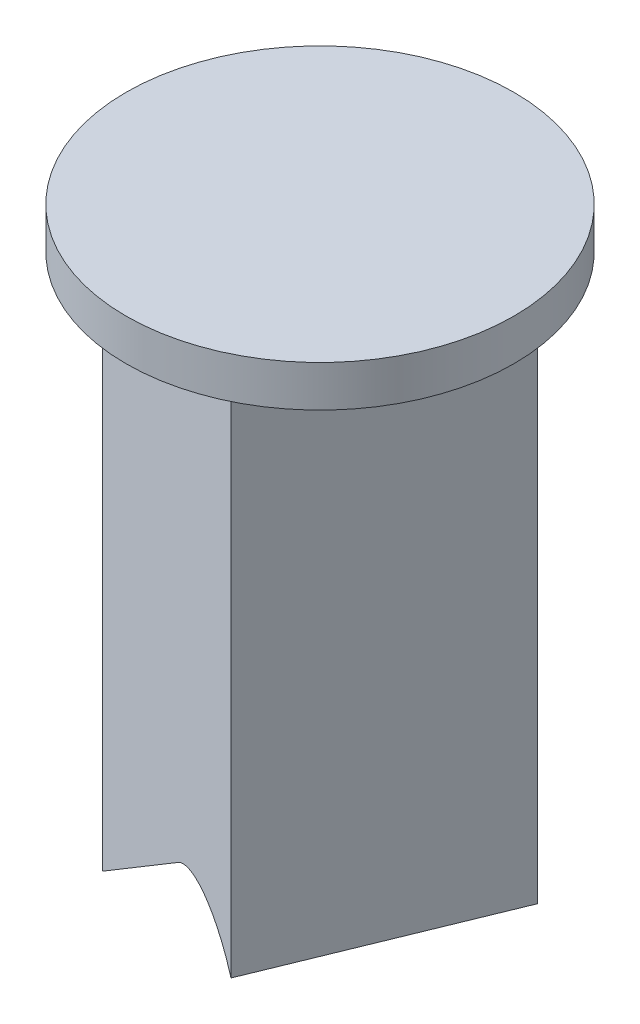
ISO-10303-21;
HEADER;
FILE_DESCRIPTION(('STEP AP214'),'2;1');
FILE_NAME('part.step','',(''),(''),'','','');
FILE_SCHEMA(('AUTOMOTIVE_DESIGN { 1 0 10303 214 1 1 1 1 }'));
ENDSEC;
DATA;
#1=APPLICATION_CONTEXT('core data for automotive mechanical design processes');
#2=APPLICATION_PROTOCOL_DEFINITION('international standard','automotive_design',2000,#1);
#3=PRODUCT_CONTEXT('',#1,'mechanical');
#4=PRODUCT('Part','Part','',(#3));
#5=PRODUCT_RELATED_PRODUCT_CATEGORY('part','',(#4));
#6=PRODUCT_DEFINITION_FORMATION('','',#4);
#7=PRODUCT_DEFINITION_CONTEXT('part definition',#1,'design');
#8=PRODUCT_DEFINITION('design','',#6,#7);
#9=PRODUCT_DEFINITION_SHAPE('','',#8);
#10=(LENGTH_UNIT() NAMED_UNIT(*) SI_UNIT(.MILLI.,.METRE.));
#11=(NAMED_UNIT(*) PLANE_ANGLE_UNIT() SI_UNIT($,.RADIAN.));
#12=(NAMED_UNIT(*) SI_UNIT($,.STERADIAN.) SOLID_ANGLE_UNIT());
#13=UNCERTAINTY_MEASURE_WITH_UNIT(LENGTH_MEASURE(1.E-05),#10,'distance_accuracy_value','');
#14=(GEOMETRIC_REPRESENTATION_CONTEXT(3) GLOBAL_UNCERTAINTY_ASSIGNED_CONTEXT((#13)) GLOBAL_UNIT_ASSIGNED_CONTEXT((#10,
#11,#12)) REPRESENTATION_CONTEXT('',''));
#15=CARTESIAN_POINT('',(0.,0.,0.));
#16=DIRECTION('',(0.,0.,1.));
#17=DIRECTION('',(1.,0.,0.));
#18=AXIS2_PLACEMENT_3D('',#15,#16,#17);
#19=CARTESIAN_POINT('',(1.69679025132942,84.4279828908245,-0.231428375549563));
#20=DIRECTION('',(0.990826424131254,0.,-0.13514065725485));
#21=DIRECTION('',(-0.13514065725485,0.,-0.990826424131254));
#22=AXIS2_PLACEMENT_3D('',#19,#20,#21);
#23=PLANE('',#22);
#24=DIRECTION('',(-0.13514065725485,0.,-0.990826424131254));
#25=VECTOR('',#24,1.);
#26=CARTESIAN_POINT('',(1.69679025132941,105.994845223969,-0.231428375549563));
#27=LINE('',#26,#25);
#28=CARTESIAN_POINT('',(1.87402518821242,105.994845223969,1.06802555867063));
#29=VERTEX_POINT('',#28);
#30=CARTESIAN_POINT('',(1.51955531444767,105.994845223969,-1.5308823097605));
#31=VERTEX_POINT('',#30);
#32=EDGE_CURVE('E194',#29,#31,#27,.T.);
#33=ORIENTED_EDGE('',*,*,#32,.T.);
#34=DIRECTION('',(0.,1.,0.));
#35=VECTOR('',#34,1.);
#36=CARTESIAN_POINT('',(1.51955531444767,84.4279828908245,-1.5308823097605));
#37=LINE('',#36,#35);
#38=CARTESIAN_POINT('',(1.51955531444767,99.1625960772667,-1.5308823097605));
#39=VERTEX_POINT('',#38);
#40=EDGE_CURVE('E191',#39,#31,#37,.T.);
#41=ORIENTED_EDGE('',*,*,#40,.F.);
#42=CARTESIAN_POINT('',(1.56317408094084,97.596592381683,-1.2110775425842));
#43=DIRECTION('',(0.990826424131254,0.,-0.13514065725485));
#44=DIRECTION('',(-0.0780237679722807,-0.816495151816892,-0.572055905214621));
#45=AXIS2_PLACEMENT_3D('',#42,#43,#44);
#46=ELLIPSE('',#45,1.97990245275013,1.4);
#47=CARTESIAN_POINT('',(1.71765298975573,99.2131759649167,-0.0784666175380269));
#48=VERTEX_POINT('',#47);
#49=EDGE_CURVE('E308',#39,#48,#46,.T.);
#50=ORIENTED_EDGE('',*,*,#49,.T.);
#51=DIRECTION('',(0.110342077724226,-0.577348248112858,0.80900780359927));
#52=VECTOR('',#51,1.);
#53=CARTESIAN_POINT('',(2.64564707959972,94.3575871172102,6.72541523661846));
#54=LINE('',#53,#52);
#55=CARTESIAN_POINT('',(1.87402518821242,98.3949820655943,1.06802555867063));
#56=VERTEX_POINT('',#55);
#57=EDGE_CURVE('E306',#48,#56,#54,.T.);
#58=ORIENTED_EDGE('',*,*,#57,.T.);
#59=DIRECTION('',(0.,1.,0.));
#60=VECTOR('',#59,1.);
#61=CARTESIAN_POINT('',(1.87402518821242,84.4279828908245,1.06802555867063));
#62=LINE('',#61,#60);
#63=EDGE_CURVE('E242',#56,#29,#62,.T.);
#64=ORIENTED_EDGE('',*,*,#63,.T.);
#65=EDGE_LOOP('',(#33,#41,#50,#58,#64));
#66=FACE_BOUND('',#65,.T.);
#67=ADVANCED_FACE('F45',(#66),#23,.F.);
#68=CARTESIAN_POINT('',(5.27521365824453E-12,84.4279828908245,3.99486966809603E-12));
#69=DIRECTION('',(0.,1.,0.));
#70=DIRECTION('',(-1.,0.,0.));
#71=AXIS2_PLACEMENT_3D('',#68,#69,#70);
#72=CYLINDRICAL_SURFACE('',#71,2.157);
#73=CARTESIAN_POINT('',(5.26940020144552E-12,105.994845223969,3.99574957758482E-12));
#74=DIRECTION('',(0.,1.,0.));
#75=DIRECTION('',(0.,0.,1.));
#76=AXIS2_PLACEMENT_3D('',#73,#74,#75);
#77=CIRCLE('',#76,2.157);
#78=CARTESIAN_POINT('',(1.53088230976976,105.994845223969,1.51955531444639));
#79=VERTEX_POINT('',#78);
#80=EDGE_CURVE('E60',#79,#29,#77,.T.);
#81=ORIENTED_EDGE('',*,*,#80,.T.);
#82=ORIENTED_EDGE('',*,*,#63,.F.);
#83=CARTESIAN_POINT('',(5.27063345056733E-12,101.419716354481,3.99556291625029E-12));
#84=DIRECTION('',(0.755791962372009,0.577350269189626,0.308942027378171));
#85=DIRECTION('',(-0.534425621759536,0.816496580927726,-0.218455002552625));
#86=AXIS2_PLACEMENT_3D('',#83,#84,#85);
#87=ELLIPSE('',#86,3.73603359192607,2.157);
#88=CARTESIAN_POINT('',(1.53088230976977,98.6025650835591,1.51955531444639));
#89=VERTEX_POINT('',#88);
#90=EDGE_CURVE('E304',#56,#89,#87,.F.);
#91=ORIENTED_EDGE('',*,*,#90,.T.);
#92=DIRECTION('',(0.,1.,0.));
#93=VECTOR('',#92,1.);
#94=CARTESIAN_POINT('',(1.53088230976977,84.4279828908245,1.51955531444639));
#95=LINE('',#94,#93);
#96=EDGE_CURVE('E240',#89,#79,#95,.T.);
#97=ORIENTED_EDGE('',*,*,#96,.T.);
#98=EDGE_LOOP('',(#81,#82,#91,#97));
#99=FACE_BOUND('',#98,.T.);
#100=ADVANCED_FACE('F363',(#99),#72,.F.);
#101=CARTESIAN_POINT('',(0.231428375549567,84.4279828908245,1.6967902513294));
#102=DIRECTION('',(0.135140657254849,0.,0.990826424131254));
#103=DIRECTION('',(0.990826424131254,0.,-0.135140657254849));
#104=AXIS2_PLACEMENT_3D('',#101,#102,#103);
#105=PLANE('',#104);
#106=DIRECTION('',(0.990826424131254,0.,-0.135140657254849));
#107=VECTOR('',#106,1.);
#108=CARTESIAN_POINT('',(0.231428375549562,105.994845223969,1.6967902513294));
#109=LINE('',#108,#107);
#110=CARTESIAN_POINT('',(-1.06802555866137,105.994845223969,1.87402518821114));
#111=VERTEX_POINT('',#110);
#112=EDGE_CURVE('E68',#111,#79,#109,.T.);
#113=ORIENTED_EDGE('',*,*,#112,.T.);
#114=ORIENTED_EDGE('',*,*,#96,.F.);
#115=DIRECTION('',(-0.626652995130878,0.774597211549112,0.0854703665245491));
#116=VECTOR('',#115,1.);
#117=CARTESIAN_POINT('',(7.89149594051099,90.7402974164519,0.652019401326001));
#118=LINE('',#117,#116);
#119=CARTESIAN_POINT('',(1.2123016364258,98.9963583042778,1.56300712450702));
#120=VERTEX_POINT('',#119);
#121=EDGE_CURVE('E292',#89,#120,#118,.T.);
#122=ORIENTED_EDGE('',*,*,#121,.T.);
#123=CARTESIAN_POINT('',(0.231433519546333,97.7839248611027,1.69678954973012));
#124=DIRECTION('',(0.135140657254849,0.,0.990826424131254));
#125=DIRECTION('',(-4.24800605209362E-06,0.999999999990809,5.79393439582368E-07));
#126=AXIS2_PLACEMENT_3D('',#123,#124,#125);
#127=ELLIPSE('',#126,1.7146428199561,1.4);
#128=CARTESIAN_POINT('',(-0.749434597332885,98.996362548524,1.83057197495319));
#129=VERTEX_POINT('',#128);
#130=EDGE_CURVE('E289',#120,#129,#127,.T.);
#131=ORIENTED_EDGE('',*,*,#130,.T.);
#132=DIRECTION('',(0.626654311327413,0.774596126929299,-0.0854705460430404));
#133=VECTOR('',#132,1.);
#134=CARTESIAN_POINT('',(-7.42863837957463,90.7403188459972,2.74156099087759));
#135=LINE('',#134,#133);
#136=CARTESIAN_POINT('',(-1.06802555866136,98.6025579895209,1.87402518821114));
#137=VERTEX_POINT('',#136);
#138=EDGE_CURVE('E286',#137,#129,#135,.T.);
#139=ORIENTED_EDGE('',*,*,#138,.F.);
#140=DIRECTION('',(0.,1.,0.));
#141=VECTOR('',#140,1.);
#142=CARTESIAN_POINT('',(-1.06802555866136,84.4279828908245,1.87402518821114));
#143=LINE('',#142,#141);
#144=EDGE_CURVE('E238',#137,#111,#143,.T.);
#145=ORIENTED_EDGE('',*,*,#144,.T.);
#146=EDGE_LOOP('',(#113,#114,#122,#131,#139,#145));
#147=FACE_BOUND('',#146,.T.);
#148=ADVANCED_FACE('F367',(#147),#105,.F.);
#149=CARTESIAN_POINT('',(5.27521365824453E-12,84.4279828908245,3.99486966809603E-12));
#150=DIRECTION('',(0.,1.,0.));
#151=DIRECTION('',(-1.,0.,0.));
#152=AXIS2_PLACEMENT_3D('',#149,#150,#151);
#153=CYLINDRICAL_SURFACE('',#152,2.157);
#154=CARTESIAN_POINT('',(5.26940020144552E-12,105.994845223969,3.99574957758482E-12));
#155=DIRECTION('',(0.,1.,0.));
#156=DIRECTION('',(0.,0.,1.));
#157=AXIS2_PLACEMENT_3D('',#154,#155,#156);
#158=CIRCLE('',#157,2.157);
#159=CARTESIAN_POINT('',(-1.51955531443713,105.994845223969,1.53088230976849));
#160=VERTEX_POINT('',#159);
#161=EDGE_CURVE('E206',#160,#111,#158,.T.);
#162=ORIENTED_EDGE('',*,*,#161,.T.);
#163=ORIENTED_EDGE('',*,*,#144,.F.);
#164=CARTESIAN_POINT('',(5.27063345056733E-12,101.419716354493,3.99556291625029E-12));
#165=DIRECTION('',(0.645447625192169,-0.577350269189626,-0.500064025701167));
#166=DIRECTION('',(0.456400392674135,0.816496580927726,-0.353598663600739));
#167=AXIS2_PLACEMENT_3D('',#164,#165,#166);
#168=ELLIPSE('',#167,3.73603359192607,2.157);
#169=CARTESIAN_POINT('',(-1.51955531443713,98.3949796687338,1.53088230976849));
#170=VERTEX_POINT('',#169);
#171=EDGE_CURVE('E284',#170,#137,#168,.F.);
#172=ORIENTED_EDGE('',*,*,#171,.F.);
#173=DIRECTION('',(0.,1.,0.));
#174=VECTOR('',#173,1.);
#175=CARTESIAN_POINT('',(-1.51955531443712,84.4279828908245,1.53088230976849));
#176=LINE('',#175,#174);
#177=EDGE_CURVE('E235',#170,#160,#176,.T.);
#178=ORIENTED_EDGE('',*,*,#177,.T.);
#179=EDGE_LOOP('',(#162,#163,#172,#178));
#180=FACE_BOUND('',#179,.T.);
#181=ADVANCED_FACE('F370',(#180),#153,.F.);
#182=CARTESIAN_POINT('',(-1.69679025132013,84.4279828908245,0.231428375548295));
#183=DIRECTION('',(-0.990826424131254,0.,0.135140657254849));
#184=DIRECTION('',(0.135140657254849,0.,0.990826424131254));
#185=AXIS2_PLACEMENT_3D('',#182,#183,#184);
#186=PLANE('',#185);
#187=DIRECTION('',(0.135140657254849,0.,0.990826424131254));
#188=VECTOR('',#187,1.);
#189=CARTESIAN_POINT('',(-1.69679025132013,105.994845223969,0.231428375548297));
#190=LINE('',#189,#188);
#191=CARTESIAN_POINT('',(-1.87402518820188,105.994845223969,-1.06802555866264));
#192=VERTEX_POINT('',#191);
#193=EDGE_CURVE('E201',#192,#160,#190,.T.);
#194=ORIENTED_EDGE('',*,*,#193,.T.);
#195=ORIENTED_EDGE('',*,*,#177,.F.);
#196=DIRECTION('',(0.110341691461932,-0.577352290252244,0.809004971595235));
#197=VECTOR('',#196,1.);
#198=CARTESIAN_POINT('',(-0.747929633745744,94.3575224930994,7.18829977019641));
#199=LINE('',#198,#197);
#200=CARTESIAN_POINT('',(-1.67592618272878,99.2131752006381,0.384399886085006));
#201=VERTEX_POINT('',#200);
#202=EDGE_CURVE('E258',#201,#170,#199,.T.);
#203=ORIENTED_EDGE('',*,*,#202,.F.);
#204=CARTESIAN_POINT('',(-1.83040455077643,97.5965972763998,-0.748207074155332));
#205=DIRECTION('',(-0.990826424131254,0.,0.135140657254849));
#206=DIRECTION('',(0.0780232217149068,0.816498010041062,0.572051900156106));
#207=AXIS2_PLACEMENT_3D('',#204,#205,#206);
#208=ELLIPSE('',#207,1.97989552192486,1.4);
#209=CARTESIAN_POINT('',(-1.87402518820188,99.1625940393697,-1.06802555866264));
#210=VERTEX_POINT('',#209);
#211=EDGE_CURVE('E293',#201,#210,#208,.T.);
#212=ORIENTED_EDGE('',*,*,#211,.T.);
#213=DIRECTION('',(0.,1.,0.));
#214=VECTOR('',#213,1.);
#215=CARTESIAN_POINT('',(-1.87402518820187,84.4279828908245,-1.06802555866264));
#216=LINE('',#215,#214);
#217=EDGE_CURVE('E232',#210,#192,#216,.T.);
#218=ORIENTED_EDGE('',*,*,#217,.T.);
#219=EDGE_LOOP('',(#194,#195,#203,#212,#218));
#220=FACE_BOUND('',#219,.T.);
#221=ADVANCED_FACE('F372',(#220),#186,.F.);
#222=CARTESIAN_POINT('',(5.27521365824453E-12,84.4279828908245,3.99486966809603E-12));
#223=DIRECTION('',(0.,1.,0.));
#224=DIRECTION('',(-1.,0.,0.));
#225=AXIS2_PLACEMENT_3D('',#222,#223,#224);
#226=CYLINDRICAL_SURFACE('',#225,2.157);
#227=CARTESIAN_POINT('',(5.26940020144552E-12,105.994845223969,3.99574957758482E-12));
#228=DIRECTION('',(0.,1.,0.));
#229=DIRECTION('',(0.,0.,1.));
#230=AXIS2_PLACEMENT_3D('',#227,#228,#229);
#231=CIRCLE('',#230,2.157);
#232=CARTESIAN_POINT('',(-1.53088230975923,105.994845223969,-1.5195553144384));
#233=VERTEX_POINT('',#232);
#234=EDGE_CURVE('E199',#233,#192,#231,.T.);
#235=ORIENTED_EDGE('',*,*,#234,.T.);
#236=ORIENTED_EDGE('',*,*,#217,.F.);
#237=CARTESIAN_POINT('',(-1.87402518820187,99.1625940393697,-1.06802555866264));
#238=CARTESIAN_POINT('',(-1.85465083730353,99.1564941999162,-1.10203711976674));
#239=CARTESIAN_POINT('',(-1.83443667333543,99.1491067680724,-1.13533892768894));
#240=CARTESIAN_POINT('',(-1.79256624378793,99.131746908743,-1.20035065552737));
#241=CARTESIAN_POINT('',(-1.77090917986237,99.1217730412254,-1.23205967686143));
#242=CARTESIAN_POINT('',(-1.72681027719391,99.0994386767081,-1.29312446758193));
#243=CARTESIAN_POINT('',(-1.70438938174293,99.0871240199009,-1.32251216643267));
#244=CARTESIAN_POINT('',(-1.65869767401704,99.0599943798302,-1.37938373411636));
#245=CARTESIAN_POINT('',(-1.63542742775374,99.0451810386966,-1.406868836707));
#246=CARTESIAN_POINT('',(-1.59855445191809,99.0200105670649,-1.44833556164797));
#247=CARTESIAN_POINT('',(-1.58513459856235,99.0105060223948,-1.4630051455999));
#248=CARTESIAN_POINT('',(-1.55811307807551,98.9906357193597,-1.49175204676862));
#249=CARTESIAN_POINT('',(-1.54451083099199,98.9802657858668,-1.50582593256331));
#250=CARTESIAN_POINT('',(-1.53088230975925,98.9694841279891,-1.51955531443842));
#251=B_SPLINE_CURVE_WITH_KNOTS('',3,(#237,#238,#239,#240,#241,#242,#243,#244,#245,#246,#247,
#248,#249,#250),.UNSPECIFIED.,.F.,.F.,(4,2,2,2,2,2,4),(0.,0.118809772325773,0.237685836105329,
0.354437320291312,0.471112372494199,0.537200489031344,0.60362826349208),.UNSPECIFIED.);
#252=CARTESIAN_POINT('',(-1.53088230975922,98.9694841279891,-1.5195553144384));
#253=VERTEX_POINT('',#252);
#254=EDGE_CURVE('E260',#210,#253,#251,.T.);
#255=ORIENTED_EDGE('',*,*,#254,.T.);
#256=DIRECTION('',(0.,1.,0.));
#257=VECTOR('',#256,1.);
#258=CARTESIAN_POINT('',(-1.53088230975922,84.4279828908245,-1.5195553144384));
#259=LINE('',#258,#257);
#260=EDGE_CURVE('E183',#253,#233,#259,.T.);
#261=ORIENTED_EDGE('',*,*,#260,.T.);
#262=EDGE_LOOP('',(#235,#236,#255,#261));
#263=FACE_BOUND('',#262,.T.);
#264=ADVANCED_FACE('F317',(#263),#226,.F.);
#265=CARTESIAN_POINT('',(5.27521365824453E-12,84.4279828908245,3.99486966809603E-12));
#266=DIRECTION('',(0.,1.,0.));
#267=DIRECTION('',(-1.,0.,0.));
#268=AXIS2_PLACEMENT_3D('',#265,#266,#267);
#269=CYLINDRICAL_SURFACE('',#268,2.157);
#270=CARTESIAN_POINT('',(5.26940020144552E-12,105.994845223969,3.99574957758482E-12));
#271=DIRECTION('',(0.,1.,0.));
#272=DIRECTION('',(0.,0.,1.));
#273=AXIS2_PLACEMENT_3D('',#270,#271,#272);
#274=CIRCLE('',#273,2.157);
#275=CARTESIAN_POINT('',(1.06802555867191,105.994845223969,-1.87402518820315));
#276=VERTEX_POINT('',#275);
#277=EDGE_CURVE('E188',#31,#276,#274,.T.);
#278=ORIENTED_EDGE('',*,*,#277,.T.);
#279=DIRECTION('',(0.,1.,0.));
#280=VECTOR('',#279,1.);
#281=CARTESIAN_POINT('',(1.06802555867191,84.4279828908245,-1.87402518820315));
#282=LINE('',#281,#280);
#283=CARTESIAN_POINT('',(1.06802555867191,98.9694914171116,-1.87402518820315));
#284=VERTEX_POINT('',#283);
#285=EDGE_CURVE('E172',#284,#276,#282,.T.);
#286=ORIENTED_EDGE('',*,*,#285,.F.);
#287=CARTESIAN_POINT('',(1.06802555867191,98.9694914171116,-1.87402518820315));
#288=CARTESIAN_POINT('',(1.09809619765169,98.9887777007371,-1.85689718371007));
#289=CARTESIAN_POINT('',(1.1283796103064,99.0067500255236,-1.83867068293678));
#290=CARTESIAN_POINT('',(1.18901947366323,99.0400890522579,-1.80004577718457));
#291=CARTESIAN_POINT('',(1.21937595097576,99.055454585142,-1.77964640438208));
#292=CARTESIAN_POINT('',(1.27924527818538,99.0833352057266,-1.73709758434953));
#293=CARTESIAN_POINT('',(1.30876353441583,99.0958960857136,-1.71498566880566));
#294=CARTESIAN_POINT('',(1.36718128246435,99.1185137524441,-1.66878668451081));
#295=CARTESIAN_POINT('',(1.39608114601738,99.1285720845369,-1.6447008469554));
#296=CARTESIAN_POINT('',(1.44064638245244,99.1423758300479,-1.60550558507958));
#297=CARTESIAN_POINT('',(1.45661669966268,99.1469674485755,-1.59103243947302));
#298=CARTESIAN_POINT('',(1.48830721497731,99.1553747239066,-1.56142995569133));
#299=CARTESIAN_POINT('',(1.50402571721855,99.1591862941836,-1.54629764139145));
#300=CARTESIAN_POINT('',(1.51955531444767,99.1625960772667,-1.5308823097605));
#301=B_SPLINE_CURVE_WITH_KNOTS('',3,(#287,#288,#289,#290,#291,#292,#293,#294,#295,#296,#297,
#298,#299,#300),.UNSPECIFIED.,.F.,.F.,(4,2,2,2,2,2,4),(0.,0.118812400058613,0.237677943665814,
0.354431664658317,0.471113109073768,0.537200516989114,0.603625749227535),.UNSPECIFIED.);
#302=EDGE_CURVE('E281',#284,#39,#301,.T.);
#303=ORIENTED_EDGE('',*,*,#302,.T.);
#304=ORIENTED_EDGE('',*,*,#40,.T.);
#305=EDGE_LOOP('',(#278,#286,#303,#304));
#306=FACE_BOUND('',#305,.T.);
#307=ADVANCED_FACE('F189',(#306),#269,.F.);
#308=CARTESIAN_POINT('',(-0.231428375548291,84.4279828908245,-1.69679025132014));
#309=DIRECTION('',(-0.135140657254849,0.,-0.990826424131254));
#310=DIRECTION('',(-0.990826424131254,0.,0.135140657254849));
#311=AXIS2_PLACEMENT_3D('',#308,#309,#310);
#312=PLANE('',#311);
#313=DIRECTION('',(-0.990826424131254,0.,0.135140657254849));
#314=VECTOR('',#313,1.);
#315=CARTESIAN_POINT('',(-0.231428375548297,105.994845223969,-1.69679025132014));
#316=LINE('',#315,#314);
#317=EDGE_CURVE('E177',#276,#233,#316,.T.);
#318=ORIENTED_EDGE('',*,*,#317,.T.);
#319=ORIENTED_EDGE('',*,*,#260,.F.);
#320=CARTESIAN_POINT('',(-3.17037587672488,96.5729917814238,-1.2959417401445));
#321=DIRECTION('',(-0.135140657254849,0.,-0.990826424131254));
#322=DIRECTION('',(0.767491385261247,0.632454867844608,-0.10467957627652));
#323=AXIS2_PLACEMENT_3D('',#320,#321,#322);
#324=ELLIPSE('',#323,3.42930364681904,1.4);
#325=CARTESIAN_POINT('',(-1.20862934204489,98.9978714005574,-1.56350799555247));
#326=VERTEX_POINT('',#325);
#327=EDGE_CURVE('E246',#253,#326,#324,.T.);
#328=ORIENTED_EDGE('',*,*,#327,.T.);
#329=DIRECTION('',(-0.990826424122147,-4.28733625660042E-06,0.135140657253607));
#330=VECTOR('',#329,1.);
#331=CARTESIAN_POINT('',(-0.231490268540822,98.9978756286681,-1.69678180961988));
#332=LINE('',#331,#330);
#333=CARTESIAN_POINT('',(0.745752040706169,98.9978798572255,-1.83006970420214));
#334=VERTEX_POINT('',#333);
#335=EDGE_CURVE('E254',#334,#326,#332,.T.);
#336=ORIENTED_EDGE('',*,*,#335,.F.);
#337=CARTESIAN_POINT('',(2.70747797365165,96.5730172150773,-2.09763314970122));
#338=DIRECTION('',(-0.135140657254849,0.,-0.990826424131254));
#339=DIRECTION('',(0.767490310591276,-0.632456196227161,-0.104679429700286));
#340=AXIS2_PLACEMENT_3D('',#337,#338,#339);
#341=ELLIPSE('',#340,3.42926763319448,1.4);
#342=EDGE_CURVE('E180',#334,#284,#341,.T.);
#343=ORIENTED_EDGE('',*,*,#342,.T.);
#344=ORIENTED_EDGE('',*,*,#285,.T.);
#345=EDGE_LOOP('',(#318,#319,#328,#336,#343,#344));
#346=FACE_BOUND('',#345,.T.);
#347=ADVANCED_FACE('F174',(#346),#312,.F.);
#348=CARTESIAN_POINT('',(5.26910463337953E-12,110.994845223969,4.00554993330816E-12));
#349=DIRECTION('',(0.,-1.,0.));
#350=DIRECTION('',(1.,0.,0.));
#351=AXIS2_PLACEMENT_3D('',#348,#349,#350);
#352=CYLINDRICAL_SURFACE('',#351,4.70000000000306);
#353=CARTESIAN_POINT('',(5.26910463337953E-12,110.994845223969,4.00554993330816E-12));
#354=DIRECTION('',(0.,1.,0.));
#355=DIRECTION('',(-1.,0.,0.));
#356=AXIS2_PLACEMENT_3D('',#353,#354,#355);
#357=CIRCLE('',#356,4.70000000000306);
#358=CARTESIAN_POINT('',(-4.69999999999779,110.994845223969,4.00554993330816E-12));
#359=VERTEX_POINT('',#358);
#360=EDGE_CURVE('E11',#359,#359,#357,.T.);
#361=ORIENTED_EDGE('',*,*,#360,.F.);
#362=EDGE_LOOP('',(#361));
#363=FACE_BOUND('',#362,.T.);
#364=CARTESIAN_POINT('',(5.26937418843623E-12,109.994845223969,4.0055091341657E-12));
#365=DIRECTION('',(0.,1.,0.));
#366=DIRECTION('',(-1.,0.,0.));
#367=AXIS2_PLACEMENT_3D('',#364,#365,#366);
#368=CIRCLE('',#367,4.70000000000306);
#369=CARTESIAN_POINT('',(-4.69999999999779,109.994845223969,4.0055091341657E-12));
#370=VERTEX_POINT('',#369);
#371=EDGE_CURVE('E49',#370,#370,#368,.T.);
#372=ORIENTED_EDGE('',*,*,#371,.T.);
#373=EDGE_LOOP('',(#372));
#374=FACE_BOUND('',#373,.T.);
#375=ADVANCED_FACE('F47',(#363,#374),#352,.T.);
#376=CARTESIAN_POINT('',(5.26910463337953E-12,110.994845223969,4.00554993330816E-12));
#377=DIRECTION('',(0.,1.,0.));
#378=DIRECTION('',(-1.,0.,0.));
#379=AXIS2_PLACEMENT_3D('',#376,#377,#378);
#380=PLANE('',#379);
#381=ORIENTED_EDGE('',*,*,#360,.T.);
#382=EDGE_LOOP('',(#381));
#383=FACE_BOUND('',#382,.T.);
#384=ADVANCED_FACE('F348',(#383),#380,.T.);
#385=CARTESIAN_POINT('',(5.26937418843623E-12,109.994845223969,4.0055091341657E-12));
#386=DIRECTION('',(0.,1.,0.));
#387=DIRECTION('',(-1.,0.,0.));
#388=AXIS2_PLACEMENT_3D('',#385,#386,#387);
#389=PLANE('',#388);
#390=DIRECTION('',(0.378375163588735,0.,-0.925652329754103));
#391=VECTOR('',#390,1.);
#392=CARTESIAN_POINT('',(2.63810913980506,109.994845223969,1.07836921623029));
#393=LINE('',#392,#391);
#394=CARTESIAN_POINT('',(1.55973992357651,109.994845223969,3.71647835603112));
#395=VERTEX_POINT('',#394);
#396=CARTESIAN_POINT('',(3.71647835603229,109.994845223969,-1.55973992356727));
#397=VERTEX_POINT('',#396);
#398=EDGE_CURVE('E210',#395,#397,#393,.T.);
#399=ORIENTED_EDGE('',*,*,#398,.T.);
#400=DIRECTION('',(-0.925652329754103,0.,-0.378375163588735));
#401=VECTOR('',#400,1.);
#402=CARTESIAN_POINT('',(1.07836921622723,109.994845223969,-2.63810913979756));
#403=LINE('',#402,#401);
#404=CARTESIAN_POINT('',(-1.5597399235661,109.994845223969,-3.71647835602306));
#405=VERTEX_POINT('',#404);
#406=EDGE_CURVE('E213',#397,#405,#403,.T.);
#407=ORIENTED_EDGE('',*,*,#406,.T.);
#408=DIRECTION('',(-0.378375163588735,0.,0.925652329754103));
#409=VECTOR('',#408,1.);
#410=CARTESIAN_POINT('',(-2.63810913979332,109.994845223969,-1.07836921622549));
#411=LINE('',#410,#409);
#412=CARTESIAN_POINT('',(-3.71647835602188,109.994845223969,1.55973992357533));
#413=VERTEX_POINT('',#412);
#414=EDGE_CURVE('E216',#405,#413,#411,.T.);
#415=ORIENTED_EDGE('',*,*,#414,.T.);
#416=DIRECTION('',(0.925652329754103,0.,0.378375163588735));
#417=VECTOR('',#416,1.);
#418=CARTESIAN_POINT('',(-1.07836921622856,109.994845223969,2.63810913980082));
#419=LINE('',#418,#417);
#420=EDGE_CURVE('E184',#413,#395,#419,.T.);
#421=ORIENTED_EDGE('',*,*,#420,.T.);
#422=EDGE_LOOP('',(#399,#407,#415,#421));
#423=FACE_BOUND('',#422,.T.);
#424=ORIENTED_EDGE('',*,*,#371,.F.);
#425=EDGE_LOOP('',(#424));
#426=FACE_BOUND('',#425,.T.);
#427=ADVANCED_FACE('F415',(#423,#426),#389,.F.);
#428=CARTESIAN_POINT('',(-43.2279765681012,67.4715205261373,-16.6006638971923));
#429=DIRECTION('',(0.645447625192169,-0.577350269189626,-0.500064025701167));
#430=DIRECTION('',(-0.110344337179841,0.577350269189626,-0.809006053079338));
#431=AXIS2_PLACEMENT_3D('',#428,#429,#430);
#432=PLANE('',#431);
#433=ORIENTED_EDGE('',*,*,#138,.T.);
#434=DIRECTION('',(-0.110344337179841,0.577350269189626,-0.809006053079338));
#435=VECTOR('',#434,1.);
#436=CARTESIAN_POINT('',(-0.903626675268665,99.8031356007564,0.700089635985224));
#437=LINE('',#436,#435);
#438=CARTESIAN_POINT('',(-0.613364941533898,98.284410721979,2.82818705874668));
#439=VERTEX_POINT('',#438);
#440=EDGE_CURVE('E264',#439,#129,#437,.T.);
#441=ORIENTED_EDGE('',*,*,#440,.F.);
#442=DIRECTION('',(0.755791962372008,0.577350269189626,0.308942027378171));
#443=VECTOR('',#442,1.);
#444=CARTESIAN_POINT('',(-6.96971281551228,93.4287899442894,0.229928415264007));
#445=LINE('',#444,#443);
#446=CARTESIAN_POINT('',(-3.71647835602188,95.9139391446447,1.55973992357533));
#447=VERTEX_POINT('',#446);
#448=EDGE_CURVE('E229',#447,#439,#445,.T.);
#449=ORIENTED_EDGE('',*,*,#448,.F.);
#450=DIRECTION('',(-0.239305465395842,-0.774596669241484,0.585433936692843));
#451=VECTOR('',#450,1.);
#452=CARTESIAN_POINT('',(-5.41422743638977,90.4185745457399,5.71309231773129));
#453=LINE('',#452,#451);
#454=CARTESIAN_POINT('',(-3.01268144140319,98.1920264628107,-0.162020161076108));
#455=VERTEX_POINT('',#454);
#456=EDGE_CURVE('E278',#455,#447,#453,.T.);
#457=ORIENTED_EDGE('',*,*,#456,.F.);
#458=DIRECTION('',(0.755791962372009,0.577350269189626,0.308942027378171));
#459=VECTOR('',#458,1.);
#460=CARTESIAN_POINT('',(-43.2279765681012,67.4715205261373,-16.6006638971923));
#461=LINE('',#460,#459);
#462=EDGE_CURVE('E261',#201,#455,#461,.F.);
#463=ORIENTED_EDGE('',*,*,#462,.F.);
#464=ORIENTED_EDGE('',*,*,#202,.T.);
#465=ORIENTED_EDGE('',*,*,#171,.T.);
#466=EDGE_LOOP('',(#433,#441,#449,#457,#463,#464,#465));
#467=FACE_BOUND('',#466,.T.);
#468=ADVANCED_FACE('F329',(#467),#432,.T.);
#469=CARTESIAN_POINT('',(2.22044604925031E-13,98.994845223891,3.5527136788005E-12));
#470=DIRECTION('',(-0.110344337179841,0.577350269189626,-0.809006053079338));
#471=DIRECTION('',(-0.645447625192168,0.577350269189626,0.500064025701167));
#472=AXIS2_PLACEMENT_3D('',#469,#470,#471);
#473=CYLINDRICAL_SURFACE('',#472,1.4);
#474=DIRECTION('',(-0.110344337179841,0.577350269189626,-0.809006053079338));
#475=VECTOR('',#474,1.);
#476=CARTESIAN_POINT('',(1.05810874732115,99.8031356007566,0.432518838332951));
#477=LINE('',#476,#475);
#478=CARTESIAN_POINT('',(1.50285255310772,97.4761203451137,3.69322473540556));
#479=VERTEX_POINT('',#478);
#480=EDGE_CURVE('E270',#120,#479,#477,.F.);
#481=ORIENTED_EDGE('',*,*,#480,.T.);
#482=CARTESIAN_POINT('',(0.444743805786778,96.6678299682482,3.26070589707607));
#483=DIRECTION('',(-0.378375163588735,0.,0.925652329754103));
#484=DIRECTION('',(-0.534425621759536,0.816496580927726,-0.218455002552625));
#485=AXIS2_PLACEMENT_3D('',#482,#483,#484);
#486=ELLIPSE('',#485,1.97989898732233,1.4);
#487=EDGE_CURVE('E247',#479,#439,#486,.T.);
#488=ORIENTED_EDGE('',*,*,#487,.T.);
#489=ORIENTED_EDGE('',*,*,#440,.T.);
#490=ORIENTED_EDGE('',*,*,#130,.F.);
#491=EDGE_LOOP('',(#481,#488,#489,#490));
#492=FACE_BOUND('',#491,.T.);
#493=ADVANCED_FACE('F331',(#492),#473,.F.);
#494=CARTESIAN_POINT('',(37.2031757580826,67.4715205261375,-27.5710666009321));
#495=DIRECTION('',(0.755791962372009,0.577350269189626,0.308942027378171));
#496=DIRECTION('',(-0.110344337179841,0.577350269189626,-0.809006053079338));
#497=AXIS2_PLACEMENT_3D('',#494,#495,#496);
#498=PLANE('',#497);
#499=DIRECTION('',(-0.645447625192168,0.577350269189626,0.500064025701167));
#500=VECTOR('',#499,1.);
#501=CARTESIAN_POINT('',(37.2031757580826,67.4715205261375,-27.5710666009321));
#502=LINE('',#501,#500);
#503=CARTESIAN_POINT('',(3.65959098556524,97.4761203451112,-1.58299354419212));
#504=VERTEX_POINT('',#503);
#505=EDGE_CURVE('E273',#504,#48,#502,.T.);
#506=ORIENTED_EDGE('',*,*,#505,.F.);
#507=DIRECTION('',(0.534425621759536,-0.816496580927726,0.218455002552625));
#508=VECTOR('',#507,1.);
#509=CARTESIAN_POINT('',(8.49282583752654,90.0918940453797,0.392668342014601));
#510=LINE('',#509,#508);
#511=CARTESIAN_POINT('',(3.7164783560323,97.3892077017177,-1.55973992356727));
#512=VERTEX_POINT('',#511);
#513=EDGE_CURVE('E299',#504,#512,#510,.T.);
#514=ORIENTED_EDGE('',*,*,#513,.T.);
#515=DIRECTION('',(-0.378375163588735,0.,0.925652329754103));
#516=VECTOR('',#515,1.);
#517=CARTESIAN_POINT('',(2.63810913980507,97.3892077017177,1.07836921623029));
#518=LINE('',#517,#516);
#519=CARTESIAN_POINT('',(1.5597399235765,97.3892077017177,3.71647835603111));
#520=VERTEX_POINT('',#519);
#521=EDGE_CURVE('E294',#512,#520,#518,.T.);
#522=ORIENTED_EDGE('',*,*,#521,.T.);
#523=DIRECTION('',(-0.534425621759536,0.816496580927726,-0.218455002552625));
#524=VECTOR('',#523,1.);
#525=CARTESIAN_POINT('',(6.33608740507075,90.0918940453797,5.66888662161298));
#526=LINE('',#525,#524);
#527=EDGE_CURVE('E251',#520,#479,#526,.T.);
#528=ORIENTED_EDGE('',*,*,#527,.T.);
#529=ORIENTED_EDGE('',*,*,#480,.F.);
#530=ORIENTED_EDGE('',*,*,#121,.F.);
#531=ORIENTED_EDGE('',*,*,#90,.F.);
#532=ORIENTED_EDGE('',*,*,#57,.F.);
#533=EDGE_LOOP('',(#506,#514,#522,#528,#529,#530,#531,#532));
#534=FACE_BOUND('',#533,.T.);
#535=ADVANCED_FACE('F327',(#534),#498,.F.);
#536=CARTESIAN_POINT('',(-42.3243498928321,66.6632301492719,-17.300753533174));
#537=DIRECTION('',(0.755791962372009,0.577350269189626,0.308942027378171));
#538=DIRECTION('',(-0.378375163588727,0.,0.925652329754106));
#539=AXIS2_PLACEMENT_3D('',#536,#537,#538);
#540=CYLINDRICAL_SURFACE('',#539,1.4);
#541=CARTESIAN_POINT('',(-2.63810913979454,96.9795908975125,-1.07836921622252));
#542=DIRECTION('',(-0.925652329754103,0.,-0.378375163588735));
#543=DIRECTION('',(0.,1.,0.));
#544=AXIS2_PLACEMENT_3D('',#541,#542,#543);
#545=ELLIPSE('',#544,1.71464281994823,1.4);
#546=CARTESIAN_POINT('',(-2.26353683818591,98.1920264628107,-1.99471827136886));
#547=VERTEX_POINT('',#546);
#548=EDGE_CURVE('E288',#455,#547,#545,.T.);
#549=ORIENTED_EDGE('',*,*,#548,.T.);
#550=DIRECTION('',(0.755791962372009,0.577350269189626,0.308942027378171));
#551=VECTOR('',#550,1.);
#552=CARTESIAN_POINT('',(-42.4788319648839,67.4715205261373,-18.433362007485));
#553=LINE('',#552,#551);
#554=EDGE_CURVE('E267',#547,#326,#553,.T.);
#555=ORIENTED_EDGE('',*,*,#554,.T.);
#556=ORIENTED_EDGE('',*,*,#327,.F.);
#557=ORIENTED_EDGE('',*,*,#254,.F.);
#558=ORIENTED_EDGE('',*,*,#211,.F.);
#559=ORIENTED_EDGE('',*,*,#462,.T.);
#560=EDGE_LOOP('',(#549,#555,#556,#557,#558,#559));
#561=FACE_BOUND('',#560,.T.);
#562=ADVANCED_FACE('F321',(#561),#540,.F.);
#563=CARTESIAN_POINT('',(-6.33376495412263,35.1399054515182,-46.4369474467503));
#564=DIRECTION('',(0.110344337179841,-0.577350269189626,0.809006053079338));
#565=DIRECTION('',(0.645447625192169,-0.577350269189626,-0.500064025701167));
#566=AXIS2_PLACEMENT_3D('',#563,#564,#565);
#567=PLANE('',#566);
#568=DIRECTION('',(0.645447625192169,-0.577350269189626,-0.500064025701167));
#569=VECTOR('',#568,1.);
#570=CARTESIAN_POINT('',(35.9905849387099,67.4715205261374,-29.1361939135728));
#571=LINE('',#570,#569);
#572=CARTESIAN_POINT('',(1.54337349092333,98.2844107219766,-2.4480312208511));
#573=VERTEX_POINT('',#572);
#574=EDGE_CURVE('E250',#334,#573,#571,.T.);
#575=ORIENTED_EDGE('',*,*,#574,.F.);
#576=ORIENTED_EDGE('',*,*,#335,.T.);
#577=ORIENTED_EDGE('',*,*,#554,.F.);
#578=DIRECTION('',(-0.239305465395843,0.774596669241484,0.585433936692843));
#579=VECTOR('',#578,1.);
#580=CARTESIAN_POINT('',(0.138009156801653,90.4185745457367,-7.86983075017866));
#581=LINE('',#580,#579);
#582=CARTESIAN_POINT('',(-1.55973992356609,95.913939144641,-3.71647835602306));
#583=VERTEX_POINT('',#582);
#584=EDGE_CURVE('E280',#583,#547,#581,.T.);
#585=ORIENTED_EDGE('',*,*,#584,.F.);
#586=DIRECTION('',(-0.755791962372009,-0.577350269189626,-0.308942027378171));
#587=VECTOR('',#586,1.);
#588=CARTESIAN_POINT('',(-4.81297438305489,93.428789944287,-5.04628986433372));
#589=LINE('',#588,#587);
#590=EDGE_CURVE('E298',#573,#583,#589,.T.);
#591=ORIENTED_EDGE('',*,*,#590,.F.);
#592=EDGE_LOOP('',(#575,#576,#577,#585,#591));
#593=FACE_BOUND('',#592,.T.);
#594=ADVANCED_FACE('F326',(#593),#567,.T.);
#595=CARTESIAN_POINT('',(36.1450670107617,66.6632301492719,-28.0035854392617));
#596=DIRECTION('',(0.645447625192168,-0.577350269189626,-0.500064025701167));
#597=DIRECTION('',(-0.110344337179847,0.577350269189621,-0.809006053079341));
#598=AXIS2_PLACEMENT_3D('',#595,#596,#597);
#599=CYLINDRICAL_SURFACE('',#598,1.4);
#600=CARTESIAN_POINT('',(2.60148223824418,96.6678299682457,-2.01551238252165));
#601=DIRECTION('',(0.378375163588735,0.,-0.925652329754103));
#602=DIRECTION('',(0.534425621759536,-0.816496580927726,0.218455002552625));
#603=AXIS2_PLACEMENT_3D('',#600,#601,#602);
#604=ELLIPSE('',#603,1.97989898732233,1.4);
#605=EDGE_CURVE('E297',#573,#504,#604,.T.);
#606=ORIENTED_EDGE('',*,*,#605,.T.);
#607=ORIENTED_EDGE('',*,*,#505,.T.);
#608=ORIENTED_EDGE('',*,*,#49,.F.);
#609=ORIENTED_EDGE('',*,*,#302,.F.);
#610=ORIENTED_EDGE('',*,*,#342,.F.);
#611=ORIENTED_EDGE('',*,*,#574,.T.);
#612=EDGE_LOOP('',(#606,#607,#608,#609,#610,#611));
#613=FACE_BOUND('',#612,.T.);
#614=ADVANCED_FACE('F340',(#613),#599,.F.);
#615=CARTESIAN_POINT('',(1.07836921622724,84.4279828908245,-2.63810913979757));
#616=DIRECTION('',(0.378375163588735,0.,-0.925652329754103));
#617=DIRECTION('',(-0.925652329754103,0.,-0.378375163588735));
#618=AXIS2_PLACEMENT_3D('',#615,#616,#617);
#619=PLANE('',#618);
#620=ORIENTED_EDGE('',*,*,#605,.F.);
#621=ORIENTED_EDGE('',*,*,#590,.T.);
#622=DIRECTION('',(0.,1.,0.));
#623=VECTOR('',#622,1.);
#624=CARTESIAN_POINT('',(-1.55973992356609,84.4279828908245,-3.71647835602306));
#625=LINE('',#624,#623);
#626=EDGE_CURVE('E226',#583,#405,#625,.T.);
#627=ORIENTED_EDGE('',*,*,#626,.T.);
#628=ORIENTED_EDGE('',*,*,#406,.F.);
#629=DIRECTION('',(0.,1.,0.));
#630=VECTOR('',#629,1.);
#631=CARTESIAN_POINT('',(3.7164783560323,84.4279828908245,-1.55973992356727));
#632=LINE('',#631,#630);
#633=EDGE_CURVE('E228',#512,#397,#632,.T.);
#634=ORIENTED_EDGE('',*,*,#633,.F.);
#635=ORIENTED_EDGE('',*,*,#513,.F.);
#636=EDGE_LOOP('',(#620,#621,#627,#628,#634,#635));
#637=FACE_BOUND('',#636,.T.);
#638=ADVANCED_FACE('F345',(#637),#619,.T.);
#639=CARTESIAN_POINT('',(-2.63810913979332,84.4279828908245,-1.0783692162255));
#640=DIRECTION('',(-0.925652329754103,0.,-0.378375163588735));
#641=DIRECTION('',(-0.378375163588735,0.,0.925652329754103));
#642=AXIS2_PLACEMENT_3D('',#639,#640,#641);
#643=PLANE('',#642);
#644=ORIENTED_EDGE('',*,*,#626,.F.);
#645=ORIENTED_EDGE('',*,*,#584,.T.);
#646=ORIENTED_EDGE('',*,*,#548,.F.);
#647=ORIENTED_EDGE('',*,*,#456,.T.);
#648=DIRECTION('',(0.,1.,0.));
#649=VECTOR('',#648,1.);
#650=CARTESIAN_POINT('',(-3.71647835602188,84.4279828908245,1.55973992357533));
#651=LINE('',#650,#649);
#652=EDGE_CURVE('E224',#447,#413,#651,.T.);
#653=ORIENTED_EDGE('',*,*,#652,.T.);
#654=ORIENTED_EDGE('',*,*,#414,.F.);
#655=EDGE_LOOP('',(#644,#645,#646,#647,#653,#654));
#656=FACE_BOUND('',#655,.T.);
#657=ADVANCED_FACE('F420',(#656),#643,.T.);
#658=CARTESIAN_POINT('',(2.63810913980507,84.4279828908245,1.07836921623029));
#659=DIRECTION('',(0.925652329754103,0.,0.378375163588735));
#660=DIRECTION('',(0.378375163588735,0.,-0.925652329754103));
#661=AXIS2_PLACEMENT_3D('',#658,#659,#660);
#662=PLANE('',#661);
#663=ORIENTED_EDGE('',*,*,#521,.F.);
#664=ORIENTED_EDGE('',*,*,#633,.T.);
#665=ORIENTED_EDGE('',*,*,#398,.F.);
#666=DIRECTION('',(0.,1.,0.));
#667=VECTOR('',#666,1.);
#668=CARTESIAN_POINT('',(1.55973992357651,84.4279828908245,3.71647835603111));
#669=LINE('',#668,#667);
#670=EDGE_CURVE('E221',#520,#395,#669,.T.);
#671=ORIENTED_EDGE('',*,*,#670,.F.);
#672=EDGE_LOOP('',(#663,#664,#665,#671));
#673=FACE_BOUND('',#672,.T.);
#674=ADVANCED_FACE('F411',(#673),#662,.T.);
#675=CARTESIAN_POINT('',(-1.07836921622855,84.4279828908245,2.63810913980082));
#676=DIRECTION('',(-0.378375163588735,0.,0.925652329754103));
#677=DIRECTION('',(0.925652329754103,0.,0.378375163588735));
#678=AXIS2_PLACEMENT_3D('',#675,#676,#677);
#679=PLANE('',#678);
#680=ORIENTED_EDGE('',*,*,#527,.F.);
#681=ORIENTED_EDGE('',*,*,#670,.T.);
#682=ORIENTED_EDGE('',*,*,#420,.F.);
#683=ORIENTED_EDGE('',*,*,#652,.F.);
#684=ORIENTED_EDGE('',*,*,#448,.T.);
#685=ORIENTED_EDGE('',*,*,#487,.F.);
#686=EDGE_LOOP('',(#680,#681,#682,#683,#684,#685));
#687=FACE_BOUND('',#686,.T.);
#688=ADVANCED_FACE('F347',(#687),#679,.T.);
#689=CARTESIAN_POINT('',(0.,105.994845223969,0.));
#690=DIRECTION('',(0.,1.,0.));
#691=DIRECTION('',(0.,0.,1.));
#692=AXIS2_PLACEMENT_3D('',#689,#690,#691);
#693=PLANE('',#692);
#694=ORIENTED_EDGE('',*,*,#32,.F.);
#695=ORIENTED_EDGE('',*,*,#80,.F.);
#696=ORIENTED_EDGE('',*,*,#112,.F.);
#697=ORIENTED_EDGE('',*,*,#161,.F.);
#698=ORIENTED_EDGE('',*,*,#193,.F.);
#699=ORIENTED_EDGE('',*,*,#234,.F.);
#700=ORIENTED_EDGE('',*,*,#317,.F.);
#701=ORIENTED_EDGE('',*,*,#277,.F.);
#702=EDGE_LOOP('',(#694,#695,#696,#697,#698,#699,#700,#701));
#703=FACE_BOUND('',#702,.T.);
#704=ADVANCED_FACE('F197',(#703),#693,.F.);
#705=CLOSED_SHELL('',(#67,#100,#148,#181,#221,#264,#307,#347,#375,#384,#427,#468,#493,#535,#562,
#594,#614,#638,#657,#674,#688,#704));
#706=MANIFOLD_SOLID_BREP('B2',#705);
#707=ADVANCED_BREP_SHAPE_REPRESENTATION('',(#18,#706),#14);
#708=SHAPE_DEFINITION_REPRESENTATION(#9,#707);
ENDSEC;
END-ISO-10303-21;
